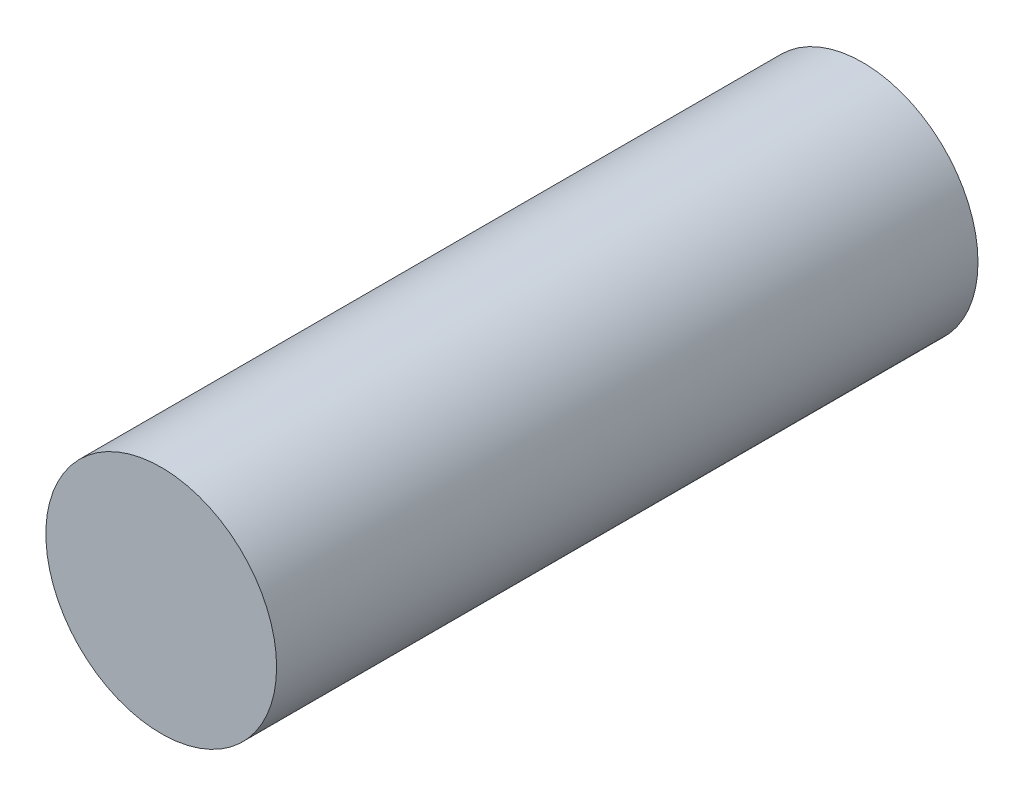
ISO-10303-21;
HEADER;
FILE_DESCRIPTION(('STEP AP214'),'2;1');
FILE_NAME('part.step','',(''),(''),'','','');
FILE_SCHEMA(('AUTOMOTIVE_DESIGN { 1 0 10303 214 1 1 1 1 }'));
ENDSEC;
DATA;
#1=APPLICATION_CONTEXT('core data for automotive mechanical design processes');
#2=APPLICATION_PROTOCOL_DEFINITION('international standard','automotive_design',2000,#1);
#3=PRODUCT_CONTEXT('',#1,'mechanical');
#4=PRODUCT('Part','Part','',(#3));
#5=PRODUCT_RELATED_PRODUCT_CATEGORY('part','',(#4));
#6=PRODUCT_DEFINITION_FORMATION('','',#4);
#7=PRODUCT_DEFINITION_CONTEXT('part definition',#1,'design');
#8=PRODUCT_DEFINITION('design','',#6,#7);
#9=PRODUCT_DEFINITION_SHAPE('','',#8);
#10=(LENGTH_UNIT() NAMED_UNIT(*) SI_UNIT(.MILLI.,.METRE.));
#11=(NAMED_UNIT(*) PLANE_ANGLE_UNIT() SI_UNIT($,.RADIAN.));
#12=(NAMED_UNIT(*) SI_UNIT($,.STERADIAN.) SOLID_ANGLE_UNIT());
#13=UNCERTAINTY_MEASURE_WITH_UNIT(LENGTH_MEASURE(1.E-05),#10,'distance_accuracy_value','');
#14=(GEOMETRIC_REPRESENTATION_CONTEXT(3) GLOBAL_UNCERTAINTY_ASSIGNED_CONTEXT((#13)) GLOBAL_UNIT_ASSIGNED_CONTEXT((#10,
#11,#12)) REPRESENTATION_CONTEXT('',''));
#15=CARTESIAN_POINT('',(0.,0.,0.));
#16=DIRECTION('',(0.,0.,1.));
#17=DIRECTION('',(1.,0.,0.));
#18=AXIS2_PLACEMENT_3D('',#15,#16,#17);
#19=CARTESIAN_POINT('',(0.,0.,30.7));
#20=DIRECTION('',(0.,0.,-1.));
#21=DIRECTION('',(-1.,0.,0.));
#22=AXIS2_PLACEMENT_3D('',#19,#20,#21);
#23=CYLINDRICAL_SURFACE('',#22,5.05);
#24=CARTESIAN_POINT('',(0.,0.,30.7));
#25=DIRECTION('',(0.,0.,1.));
#26=DIRECTION('',(1.,0.,0.));
#27=AXIS2_PLACEMENT_3D('',#24,#25,#26);
#28=CIRCLE('',#27,5.05);
#29=CARTESIAN_POINT('',(5.05,0.,30.7));
#30=VERTEX_POINT('',#29);
#31=EDGE_CURVE('E10',#30,#30,#28,.T.);
#32=ORIENTED_EDGE('',*,*,#31,.F.);
#33=EDGE_LOOP('',(#32));
#34=FACE_BOUND('',#33,.T.);
#35=CARTESIAN_POINT('',(0.,0.,0.));
#36=DIRECTION('',(0.,0.,1.));
#37=DIRECTION('',(1.,0.,0.));
#38=AXIS2_PLACEMENT_3D('',#35,#36,#37);
#39=CIRCLE('',#38,5.05);
#40=CARTESIAN_POINT('',(5.05,0.,0.));
#41=VERTEX_POINT('',#40);
#42=EDGE_CURVE('E34',#41,#41,#39,.T.);
#43=ORIENTED_EDGE('',*,*,#42,.T.);
#44=EDGE_LOOP('',(#43));
#45=FACE_BOUND('',#44,.T.);
#46=ADVANCED_FACE('F31',(#34,#45),#23,.T.);
#47=CARTESIAN_POINT('',(0.,0.,30.7));
#48=DIRECTION('',(0.,0.,1.));
#49=DIRECTION('',(1.,0.,0.));
#50=AXIS2_PLACEMENT_3D('',#47,#48,#49);
#51=PLANE('',#50);
#52=ORIENTED_EDGE('',*,*,#31,.T.);
#53=EDGE_LOOP('',(#52));
#54=FACE_BOUND('',#53,.T.);
#55=ADVANCED_FACE('F60',(#54),#51,.T.);
#56=CARTESIAN_POINT('',(0.,0.,0.));
#57=DIRECTION('',(0.,0.,1.));
#58=DIRECTION('',(1.,0.,0.));
#59=AXIS2_PLACEMENT_3D('',#56,#57,#58);
#60=PLANE('',#59);
#61=CARTESIAN_POINT('',(0.,0.,0.));
#62=DIRECTION('',(0.,0.,-1.));
#63=DIRECTION('',(-1.,0.,0.));
#64=AXIS2_PLACEMENT_3D('',#61,#62,#63);
#65=CIRCLE('',#64,2.05);
#66=CARTESIAN_POINT('',(-2.05,0.,0.));
#67=VERTEX_POINT('',#66);
#68=EDGE_CURVE('E43',#67,#67,#65,.T.);
#69=ORIENTED_EDGE('',*,*,#68,.F.);
#70=EDGE_LOOP('',(#69));
#71=FACE_BOUND('',#70,.T.);
#72=ORIENTED_EDGE('',*,*,#42,.F.);
#73=EDGE_LOOP('',(#72));
#74=FACE_BOUND('',#73,.T.);
#75=ADVANCED_FACE('F54',(#71,#74),#60,.F.);
#76=CARTESIAN_POINT('',(0.,0.,2.65));
#77=DIRECTION('',(0.,0.,-1.));
#78=DIRECTION('',(-1.,0.,0.));
#79=AXIS2_PLACEMENT_3D('',#76,#77,#78);
#80=CYLINDRICAL_SURFACE('',#79,2.05);
#81=CARTESIAN_POINT('',(0.,0.,2.65));
#82=DIRECTION('',(0.,0.,-1.));
#83=DIRECTION('',(-1.,0.,0.));
#84=AXIS2_PLACEMENT_3D('',#81,#82,#83);
#85=CIRCLE('',#84,2.05);
#86=CARTESIAN_POINT('',(-2.05,0.,2.65));
#87=VERTEX_POINT('',#86);
#88=EDGE_CURVE('E41',#87,#87,#85,.T.);
#89=ORIENTED_EDGE('',*,*,#88,.F.);
#90=EDGE_LOOP('',(#89));
#91=FACE_BOUND('',#90,.T.);
#92=ORIENTED_EDGE('',*,*,#68,.T.);
#93=EDGE_LOOP('',(#92));
#94=FACE_BOUND('',#93,.T.);
#95=ADVANCED_FACE('F51',(#91,#94),#80,.F.);
#96=CARTESIAN_POINT('',(0.,0.,2.65));
#97=DIRECTION('',(0.,0.,-1.));
#98=DIRECTION('',(-1.,0.,0.));
#99=AXIS2_PLACEMENT_3D('',#96,#97,#98);
#100=PLANE('',#99);
#101=ORIENTED_EDGE('',*,*,#88,.T.);
#102=EDGE_LOOP('',(#101));
#103=FACE_BOUND('',#102,.T.);
#104=ADVANCED_FACE('F49',(#103),#100,.T.);
#105=CLOSED_SHELL('',(#46,#55,#75,#95,#104));
#106=MANIFOLD_SOLID_BREP('B2',#105);
#107=ADVANCED_BREP_SHAPE_REPRESENTATION('',(#18,#106),#14);
#108=SHAPE_DEFINITION_REPRESENTATION(#9,#107);
ENDSEC;
END-ISO-10303-21;
